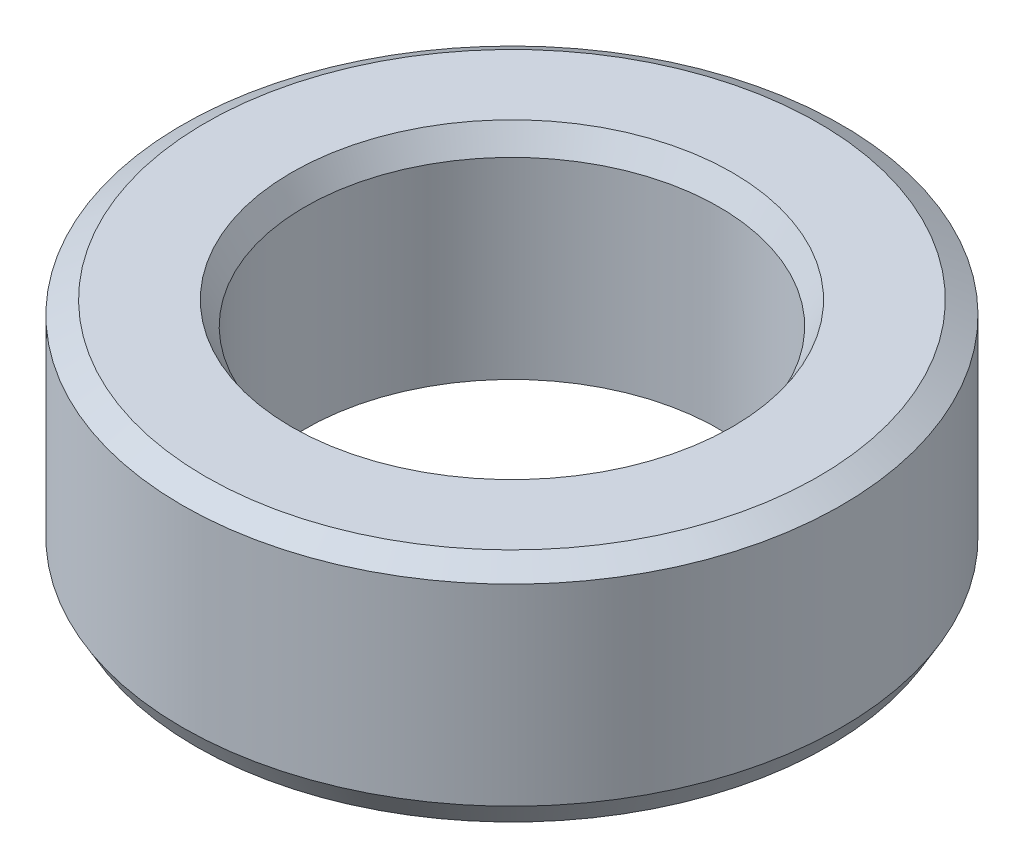
ISO-10303-21;
HEADER;
FILE_DESCRIPTION(('STEP AP214'),'2;1');
FILE_NAME('part.step','',(''),(''),'','','');
FILE_SCHEMA(('AUTOMOTIVE_DESIGN { 1 0 10303 214 1 1 1 1 }'));
ENDSEC;
DATA;
#1=APPLICATION_CONTEXT('core data for automotive mechanical design processes');
#2=APPLICATION_PROTOCOL_DEFINITION('international standard','automotive_design',2000,#1);
#3=PRODUCT_CONTEXT('',#1,'mechanical');
#4=PRODUCT('Part','Part','',(#3));
#5=PRODUCT_RELATED_PRODUCT_CATEGORY('part','',(#4));
#6=PRODUCT_DEFINITION_FORMATION('','',#4);
#7=PRODUCT_DEFINITION_CONTEXT('part definition',#1,'design');
#8=PRODUCT_DEFINITION('design','',#6,#7);
#9=PRODUCT_DEFINITION_SHAPE('','',#8);
#10=(LENGTH_UNIT() NAMED_UNIT(*) SI_UNIT(.MILLI.,.METRE.));
#11=(NAMED_UNIT(*) PLANE_ANGLE_UNIT() SI_UNIT($,.RADIAN.));
#12=(NAMED_UNIT(*) SI_UNIT($,.STERADIAN.) SOLID_ANGLE_UNIT());
#13=UNCERTAINTY_MEASURE_WITH_UNIT(LENGTH_MEASURE(1.E-05),#10,'distance_accuracy_value','');
#14=(GEOMETRIC_REPRESENTATION_CONTEXT(3) GLOBAL_UNCERTAINTY_ASSIGNED_CONTEXT((#13)) GLOBAL_UNIT_ASSIGNED_CONTEXT((#10,
#11,#12)) REPRESENTATION_CONTEXT('',''));
#15=CARTESIAN_POINT('',(0.,0.,0.));
#16=DIRECTION('',(0.,0.,1.));
#17=DIRECTION('',(1.,0.,0.));
#18=AXIS2_PLACEMENT_3D('',#15,#16,#17);
#19=CARTESIAN_POINT('',(0.,13.8835817805165,0.));
#20=DIRECTION('',(0.,-1.,0.));
#21=DIRECTION('',(0.,0.,-1.));
#22=AXIS2_PLACEMENT_3D('',#19,#20,#21);
#23=CYLINDRICAL_SURFACE('',#22,20.);
#24=CARTESIAN_POINT('',(0.,1.40210199059401,0.));
#25=DIRECTION('',(0.,1.,0.));
#26=DIRECTION('',(0.,0.,1.));
#27=AXIS2_PLACEMENT_3D('',#24,#25,#26);
#28=CIRCLE('',#27,20.);
#29=CARTESIAN_POINT('',(0.,1.40210199059401,20.));
#30=VERTEX_POINT('',#29);
#31=EDGE_CURVE('E10',#30,#30,#28,.T.);
#32=ORIENTED_EDGE('',*,*,#31,.T.);
#33=EDGE_LOOP('',(#32));
#34=FACE_BOUND('',#33,.T.);
#35=CARTESIAN_POINT('',(0.,13.0740778188157,0.));
#36=DIRECTION('',(0.,1.,0.));
#37=DIRECTION('',(0.,0.,1.));
#38=AXIS2_PLACEMENT_3D('',#35,#36,#37);
#39=CIRCLE('',#38,20.);
#40=CARTESIAN_POINT('',(0.,13.0740778188157,20.));
#41=VERTEX_POINT('',#40);
#42=EDGE_CURVE('E50',#41,#41,#39,.F.);
#43=ORIENTED_EDGE('',*,*,#42,.T.);
#44=EDGE_LOOP('',(#43));
#45=FACE_BOUND('',#44,.T.);
#46=ADVANCED_FACE('F39',(#34,#45),#23,.T.);
#47=CARTESIAN_POINT('',(0.,13.8835817805165,0.));
#48=DIRECTION('',(0.,1.,0.));
#49=DIRECTION('',(0.,0.,1.));
#50=AXIS2_PLACEMENT_3D('',#47,#48,#49);
#51=PLANE('',#50);
#52=CARTESIAN_POINT('',(0.,13.8835817805165,0.));
#53=DIRECTION('',(0.,1.,0.));
#54=DIRECTION('',(0.,0.,1.));
#55=AXIS2_PLACEMENT_3D('',#52,#53,#54);
#56=CIRCLE('',#55,13.3724455881701);
#57=CARTESIAN_POINT('',(0.,13.8835817805165,13.3724455881701));
#58=VERTEX_POINT('',#57);
#59=EDGE_CURVE('E58',#58,#58,#56,.F.);
#60=ORIENTED_EDGE('',*,*,#59,.T.);
#61=EDGE_LOOP('',(#60));
#62=FACE_BOUND('',#61,.T.);
#63=CARTESIAN_POINT('',(0.,13.8835817805165,0.));
#64=DIRECTION('',(0.,1.,0.));
#65=DIRECTION('',(0.,0.,1.));
#66=AXIS2_PLACEMENT_3D('',#63,#64,#65);
#67=CIRCLE('',#66,18.597898009406);
#68=CARTESIAN_POINT('',(0.,13.8835817805165,18.597898009406));
#69=VERTEX_POINT('',#68);
#70=EDGE_CURVE('E61',#69,#69,#67,.T.);
#71=ORIENTED_EDGE('',*,*,#70,.T.);
#72=EDGE_LOOP('',(#71));
#73=FACE_BOUND('',#72,.T.);
#74=ADVANCED_FACE('F88',(#62,#73),#51,.T.);
#75=CARTESIAN_POINT('',(0.,0.,0.));
#76=DIRECTION('',(0.,1.,0.));
#77=DIRECTION('',(0.,0.,1.));
#78=AXIS2_PLACEMENT_3D('',#75,#76,#77);
#79=PLANE('',#78);
#80=CARTESIAN_POINT('',(0.,0.,0.));
#81=DIRECTION('',(0.,1.,0.));
#82=DIRECTION('',(0.,0.,1.));
#83=AXIS2_PLACEMENT_3D('',#80,#81,#82);
#84=CIRCLE('',#83,13.9650436170633);
#85=CARTESIAN_POINT('',(0.,0.,13.9650436170633));
#86=VERTEX_POINT('',#85);
#87=EDGE_CURVE('E51',#86,#86,#84,.T.);
#88=ORIENTED_EDGE('',*,*,#87,.T.);
#89=EDGE_LOOP('',(#88));
#90=FACE_BOUND('',#89,.T.);
#91=CARTESIAN_POINT('',(0.,0.,0.));
#92=DIRECTION('',(0.,1.,0.));
#93=DIRECTION('',(0.,0.,1.));
#94=AXIS2_PLACEMENT_3D('',#91,#92,#93);
#95=CIRCLE('',#94,19.1904960382992);
#96=CARTESIAN_POINT('',(0.,0.,19.1904960382992));
#97=VERTEX_POINT('',#96);
#98=EDGE_CURVE('E54',#97,#97,#95,.F.);
#99=ORIENTED_EDGE('',*,*,#98,.T.);
#100=EDGE_LOOP('',(#99));
#101=FACE_BOUND('',#100,.T.);
#102=ADVANCED_FACE('F83',(#90,#101),#79,.F.);
#103=CARTESIAN_POINT('',(0.,13.8835817805165,0.));
#104=DIRECTION('',(0.,-1.,0.));
#105=DIRECTION('',(0.,0.,-1.));
#106=AXIS2_PLACEMENT_3D('',#103,#104,#105);
#107=CYLINDRICAL_SURFACE('',#106,12.5629416264693);
#108=CARTESIAN_POINT('',(0.,12.4814797899225,0.));
#109=DIRECTION('',(0.,1.,0.));
#110=DIRECTION('',(0.,0.,1.));
#111=AXIS2_PLACEMENT_3D('',#108,#109,#110);
#112=CIRCLE('',#111,12.5629416264693);
#113=CARTESIAN_POINT('',(0.,12.4814797899225,12.5629416264693));
#114=VERTEX_POINT('',#113);
#115=EDGE_CURVE('E67',#114,#114,#112,.T.);
#116=ORIENTED_EDGE('',*,*,#115,.T.);
#117=EDGE_LOOP('',(#116));
#118=FACE_BOUND('',#117,.T.);
#119=CARTESIAN_POINT('',(0.,0.80950396170076,0.));
#120=DIRECTION('',(0.,1.,0.));
#121=DIRECTION('',(0.,0.,1.));
#122=AXIS2_PLACEMENT_3D('',#119,#120,#121);
#123=CIRCLE('',#122,12.5629416264693);
#124=CARTESIAN_POINT('',(0.,0.80950396170076,12.5629416264693));
#125=VERTEX_POINT('',#124);
#126=EDGE_CURVE('E69',#125,#125,#123,.F.);
#127=ORIENTED_EDGE('',*,*,#126,.T.);
#128=EDGE_LOOP('',(#127));
#129=FACE_BOUND('',#128,.T.);
#130=ADVANCED_FACE('F71',(#118,#129),#107,.F.);
#131=CARTESIAN_POINT('',(0.,12.4814797899225,0.));
#132=DIRECTION('',(0.,1.,0.));
#133=DIRECTION('',(0.,0.,1.));
#134=AXIS2_PLACEMENT_3D('',#131,#132,#133);
#135=CONICAL_SURFACE('',#134,12.5629416264693,0.523598775598302);
#136=ORIENTED_EDGE('',*,*,#59,.F.);
#137=EDGE_LOOP('',(#136));
#138=FACE_BOUND('',#137,.T.);
#139=ORIENTED_EDGE('',*,*,#115,.F.);
#140=EDGE_LOOP('',(#139));
#141=FACE_BOUND('',#140,.T.);
#142=ADVANCED_FACE('F77',(#138,#141),#135,.F.);
#143=CARTESIAN_POINT('',(0.,0.,0.));
#144=DIRECTION('',(0.,-1.,0.));
#145=DIRECTION('',(0.,0.,-1.));
#146=AXIS2_PLACEMENT_3D('',#143,#144,#145);
#147=CONICAL_SURFACE('',#146,13.9650436170633,1.04719755119659);
#148=ORIENTED_EDGE('',*,*,#126,.F.);
#149=EDGE_LOOP('',(#148));
#150=FACE_BOUND('',#149,.T.);
#151=ORIENTED_EDGE('',*,*,#87,.F.);
#152=EDGE_LOOP('',(#151));
#153=FACE_BOUND('',#152,.T.);
#154=ADVANCED_FACE('F73',(#150,#153),#147,.F.);
#155=CARTESIAN_POINT('',(0.,1.40210199059401,0.));
#156=DIRECTION('',(0.,1.,0.));
#157=DIRECTION('',(0.,0.,1.));
#158=AXIS2_PLACEMENT_3D('',#155,#156,#157);
#159=CONICAL_SURFACE('',#158,20.,0.523598775598303);
#160=ORIENTED_EDGE('',*,*,#98,.F.);
#161=EDGE_LOOP('',(#160));
#162=FACE_BOUND('',#161,.T.);
#163=ORIENTED_EDGE('',*,*,#31,.F.);
#164=EDGE_LOOP('',(#163));
#165=FACE_BOUND('',#164,.T.);
#166=ADVANCED_FACE('F76',(#162,#165),#159,.T.);
#167=CARTESIAN_POINT('',(0.,13.8835817805165,0.));
#168=DIRECTION('',(0.,-1.,0.));
#169=DIRECTION('',(0.,0.,-1.));
#170=AXIS2_PLACEMENT_3D('',#167,#168,#169);
#171=CONICAL_SURFACE('',#170,18.597898009406,1.04719755119659);
#172=ORIENTED_EDGE('',*,*,#42,.F.);
#173=EDGE_LOOP('',(#172));
#174=FACE_BOUND('',#173,.T.);
#175=ORIENTED_EDGE('',*,*,#70,.F.);
#176=EDGE_LOOP('',(#175));
#177=FACE_BOUND('',#176,.T.);
#178=ADVANCED_FACE('F45',(#174,#177),#171,.T.);
#179=CLOSED_SHELL('',(#46,#74,#102,#130,#142,#154,#166,#178));
#180=MANIFOLD_SOLID_BREP('B2',#179);
#181=ADVANCED_BREP_SHAPE_REPRESENTATION('',(#18,#180),#14);
#182=SHAPE_DEFINITION_REPRESENTATION(#9,#181);
ENDSEC;
END-ISO-10303-21;
